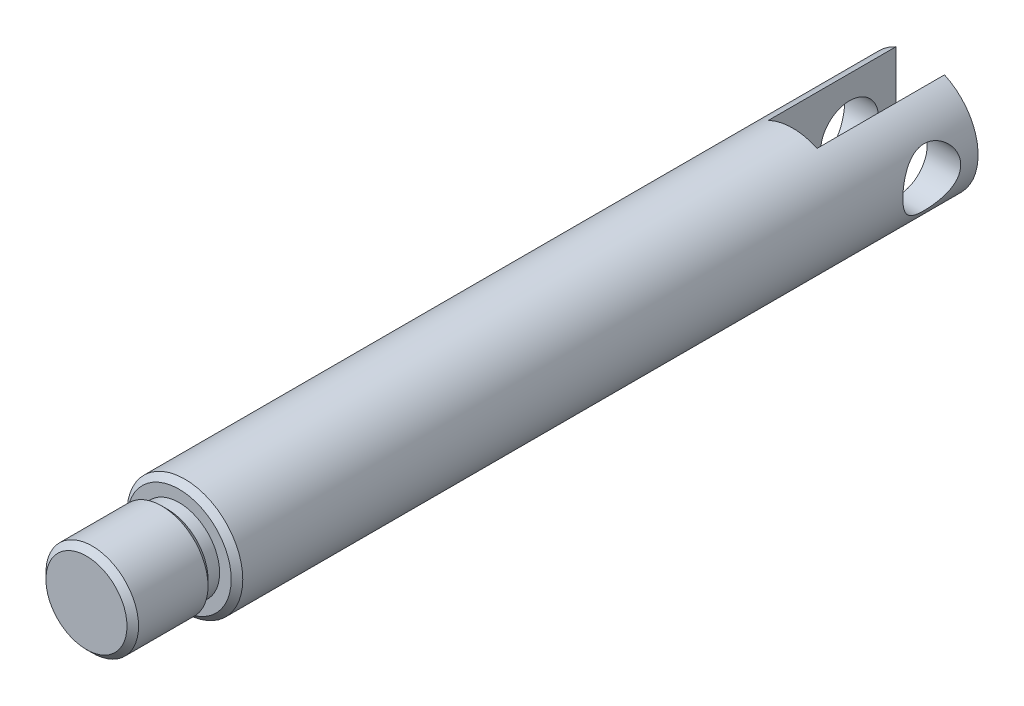
ISO-10303-21;
HEADER;
FILE_DESCRIPTION(('STEP AP214'),'2;1');
FILE_NAME('part.step','',(''),(''),'','','');
FILE_SCHEMA(('AUTOMOTIVE_DESIGN { 1 0 10303 214 1 1 1 1 }'));
ENDSEC;
DATA;
#1=APPLICATION_CONTEXT('core data for automotive mechanical design processes');
#2=APPLICATION_PROTOCOL_DEFINITION('international standard','automotive_design',2000,#1);
#3=PRODUCT_CONTEXT('',#1,'mechanical');
#4=PRODUCT('Part','Part','',(#3));
#5=PRODUCT_RELATED_PRODUCT_CATEGORY('part','',(#4));
#6=PRODUCT_DEFINITION_FORMATION('','',#4);
#7=PRODUCT_DEFINITION_CONTEXT('part definition',#1,'design');
#8=PRODUCT_DEFINITION('design','',#6,#7);
#9=PRODUCT_DEFINITION_SHAPE('','',#8);
#10=(LENGTH_UNIT() NAMED_UNIT(*) SI_UNIT(.MILLI.,.METRE.));
#11=(NAMED_UNIT(*) PLANE_ANGLE_UNIT() SI_UNIT($,.RADIAN.));
#12=(NAMED_UNIT(*) SI_UNIT($,.STERADIAN.) SOLID_ANGLE_UNIT());
#13=UNCERTAINTY_MEASURE_WITH_UNIT(LENGTH_MEASURE(1.E-05),#10,'distance_accuracy_value','');
#14=(GEOMETRIC_REPRESENTATION_CONTEXT(3) GLOBAL_UNCERTAINTY_ASSIGNED_CONTEXT((#13)) GLOBAL_UNIT_ASSIGNED_CONTEXT((#10,
#11,#12)) REPRESENTATION_CONTEXT('',''));
#15=CARTESIAN_POINT('',(0.,0.,0.));
#16=DIRECTION('',(0.,0.,1.));
#17=DIRECTION('',(1.,0.,0.));
#18=AXIS2_PLACEMENT_3D('',#15,#16,#17);
#19=CARTESIAN_POINT('',(0.,0.,0.));
#20=DIRECTION('',(0.,0.,1.));
#21=DIRECTION('',(1.,0.,0.));
#22=AXIS2_PLACEMENT_3D('',#19,#20,#21);
#23=PLANE('',#22);
#24=CARTESIAN_POINT('',(0.,0.,0.));
#25=DIRECTION('',(0.,0.,1.));
#26=DIRECTION('',(1.,0.,0.));
#27=AXIS2_PLACEMENT_3D('',#24,#25,#26);
#28=CIRCLE('',#27,2.5);
#29=CARTESIAN_POINT('',(-1.05,2.26881026090769,0.));
#30=VERTEX_POINT('',#29);
#31=CARTESIAN_POINT('',(-1.05,-2.26881026090769,0.));
#32=VERTEX_POINT('',#31);
#33=EDGE_CURVE('E107',#30,#32,#28,.T.);
#34=ORIENTED_EDGE('',*,*,#33,.F.);
#35=DIRECTION('',(0.,1.,0.));
#36=VECTOR('',#35,1.);
#37=CARTESIAN_POINT('',(-1.05,-2.5,0.));
#38=LINE('',#37,#36);
#39=EDGE_CURVE('E71',#32,#30,#38,.T.);
#40=ORIENTED_EDGE('',*,*,#39,.F.);
#41=EDGE_LOOP('',(#34,#40));
#42=FACE_BOUND('',#41,.T.);
#43=ADVANCED_FACE('F46',(#42),#23,.F.);
#44=CARTESIAN_POINT('',(-2.5,0.,2.));
#45=DIRECTION('',(1.,0.,0.));
#46=DIRECTION('',(0.,0.,-1.));
#47=AXIS2_PLACEMENT_3D('',#44,#45,#46);
#48=CYLINDRICAL_SURFACE('',#47,1.25);
#49=CARTESIAN_POINT('',(-1.05,0.,2.));
#50=DIRECTION('',(-1.,0.,0.));
#51=DIRECTION('',(0.,0.,1.));
#52=AXIS2_PLACEMENT_3D('',#49,#50,#51);
#53=CIRCLE('',#52,1.25);
#54=CARTESIAN_POINT('',(-1.05,0.,3.25));
#55=VERTEX_POINT('',#54);
#56=EDGE_CURVE('E103',#55,#55,#53,.F.);
#57=ORIENTED_EDGE('',*,*,#56,.T.);
#58=EDGE_LOOP('',(#57));
#59=FACE_BOUND('',#58,.T.);
#60=CARTESIAN_POINT('',(-2.5,0.,0.75));
#61=CARTESIAN_POINT('',(-2.49999641755189,0.065714953691233,0.750004127899376));
#62=CARTESIAN_POINT('',(-2.49738113774397,0.131508249622541,0.755212591402094));
#63=CARTESIAN_POINT('',(-2.48717695046745,0.261150294085531,0.775816100426147));
#64=CARTESIAN_POINT('',(-2.47957859786229,0.324995108391879,0.791230491247062));
#65=CARTESIAN_POINT('',(-2.46020349254139,0.448666931100718,0.831492260770993));
#66=CARTESIAN_POINT('',(-2.448442989719,0.508508503673975,0.856302980310015));
#67=CARTESIAN_POINT('',(-2.42182220644723,0.623090771008206,0.914463276706176));
#68=CARTESIAN_POINT('',(-2.40696217041912,0.677831867487562,0.947812180311065));
#69=CARTESIAN_POINT('',(-2.37445322822571,0.784384772202399,1.02439656185662));
#70=CARTESIAN_POINT('',(-2.3566899890942,0.83581901390264,1.06810809904955));
#71=CARTESIAN_POINT('',(-2.3207496280843,0.930974306083722,1.16315184905879));
#72=CARTESIAN_POINT('',(-2.30257220261294,0.974689478883458,1.21448981471555));
#73=CARTESIAN_POINT('',(-2.26623688996684,1.05656500056285,1.32810418690423));
#74=CARTESIAN_POINT('',(-2.24818983712665,1.09403166943955,1.39092012293239));
#75=CARTESIAN_POINT('',(-2.21607473465401,1.15771028361337,1.52295916998277));
#76=CARTESIAN_POINT('',(-2.20200384508737,1.18393026870792,1.59217766090344));
#77=CARTESIAN_POINT('',(-2.18072333797261,1.22266555273574,1.7308313817774));
#78=CARTESIAN_POINT('',(-2.17315339479642,1.23590732135055,1.80000556508424));
#79=CARTESIAN_POINT('',(-2.1647736243566,1.25053374163606,1.93997354722435));
#80=CARTESIAN_POINT('',(-2.1639571167911,1.25193011046634,2.01076567608894));
#81=CARTESIAN_POINT('',(-2.1688866282156,1.24335910896537,2.14285753039421));
#82=CARTESIAN_POINT('',(-2.17385954577517,1.23473069942103,2.20428003902881));
#83=CARTESIAN_POINT('',(-2.18845285917313,1.20867481132117,2.3246523867163));
#84=CARTESIAN_POINT('',(-2.1980747353972,1.19124452987206,2.38360143163164));
#85=CARTESIAN_POINT('',(-2.22109345515926,1.1477622254825,2.49903641570707));
#86=CARTESIAN_POINT('',(-2.23457300829998,1.12151883389499,2.55543299848224));
#87=CARTESIAN_POINT('',(-2.26379255351754,1.061302109585,2.66329286573751));
#88=CARTESIAN_POINT('',(-2.27953355975238,1.02732530476558,2.71475391950011));
#89=CARTESIAN_POINT('',(-2.31391447379107,0.947582568640986,2.81815156592903));
#90=CARTESIAN_POINT('',(-2.33266887795933,0.900868072961603,2.8693210919702));
#91=CARTESIAN_POINT('',(-2.36934529125509,0.799444473426718,2.96341927323863));
#92=CARTESIAN_POINT('',(-2.38726689948501,0.744731570717857,3.00634399004235));
#93=CARTESIAN_POINT('',(-2.42127484103705,0.625645632289811,3.08460707628716));
#94=CARTESIAN_POINT('',(-2.43723730202509,0.560941989499261,3.11950059055718));
#95=CARTESIAN_POINT('',(-2.46447351401553,0.425582769360996,3.17762128630376));
#96=CARTESIAN_POINT('',(-2.47575098679441,0.354931970331596,3.20085773126896));
#97=CARTESIAN_POINT('',(-2.49155417176795,0.215958114575877,3.23309425464584));
#98=CARTESIAN_POINT('',(-2.4965617287664,0.147926913185406,3.24311404468347));
#99=CARTESIAN_POINT('',(-2.50091266823877,0.0109744999366923,3.25183091391811));
#100=CARTESIAN_POINT('',(-2.5002587340164,-0.0579462748373765,3.25053335704935));
#101=CARTESIAN_POINT('',(-2.49363990316801,-0.189041214982492,3.23724163947656));
#102=CARTESIAN_POINT('',(-2.48809057110237,-0.251324260062443,3.22608433408746));
#103=CARTESIAN_POINT('',(-2.47277714143524,-0.373008615377396,3.19470241013114));
#104=CARTESIAN_POINT('',(-2.46301257917916,-0.432409607113746,3.1744767919333));
#105=CARTESIAN_POINT('',(-2.43980314267087,-0.548610760562081,3.12500191695853));
#106=CARTESIAN_POINT('',(-2.42626102212424,-0.605287996257692,3.09551118735398));
#107=CARTESIAN_POINT('',(-2.39679967896386,-0.713076702123651,3.02861558044245));
#108=CARTESIAN_POINT('',(-2.38087944457231,-0.764185787219102,2.99120733175821));
#109=CARTESIAN_POINT('',(-2.3463527667183,-0.864709611613316,2.90529946833391));
#110=CARTESIAN_POINT('',(-2.32763606060552,-0.913465097280798,2.85607141443304));
#111=CARTESIAN_POINT('',(-2.29077989504843,-1.00232040139155,2.75009356091337));
#112=CARTESIAN_POINT('',(-2.27264084226908,-1.04241423211355,2.69333860147953));
#113=CARTESIAN_POINT('',(-2.23813990282585,-1.11463489312212,2.57044543224961));
#114=CARTESIAN_POINT('',(-2.2219066207934,-1.1462818698483,2.50398591723926));
#115=CARTESIAN_POINT('',(-2.19467590460158,-1.19760353251725,2.36561241538435));
#116=CARTESIAN_POINT('',(-2.18367172800772,-1.21729364485946,2.29370559187352));
#117=CARTESIAN_POINT('',(-2.16951876260833,-1.2423271093121,2.15386222142319));
#118=CARTESIAN_POINT('',(-2.16571729325614,-1.24886624550108,2.08620718321371));
#119=CARTESIAN_POINT('',(-2.16456693307719,-1.25086144297598,1.95069116603659));
#120=CARTESIAN_POINT('',(-2.16721524534441,-1.2463223082805,1.88283028907571));
#121=CARTESIAN_POINT('',(-2.17797327562531,-1.22740765699033,1.75564562308498));
#122=CARTESIAN_POINT('',(-2.18553868102992,-1.2140103929285,1.6961244123195));
#123=CARTESIAN_POINT('',(-2.20463770234897,-1.17896919778081,1.58023985071912));
#124=CARTESIAN_POINT('',(-2.21617259462094,-1.15732261394976,1.52387752238504));
#125=CARTESIAN_POINT('',(-2.2428566295566,-1.10476968162585,1.41171893626674));
#126=CARTESIAN_POINT('',(-2.25819652995238,-1.07333892227057,1.35621512271287));
#127=CARTESIAN_POINT('',(-2.29044164543238,-1.00268871454579,1.25090682977427));
#128=CARTESIAN_POINT('',(-2.30734767243153,-0.96346521404831,1.20110533685189));
#129=CARTESIAN_POINT('',(-2.34327903949141,-0.872754158330802,1.10232252205298));
#130=CARTESIAN_POINT('',(-2.36231229139336,-0.820355528762714,1.0541761220476));
#131=CARTESIAN_POINT('',(-2.3984719031886,-0.70769350777535,0.967171270720459));
#132=CARTESIAN_POINT('',(-2.4155972326005,-0.647425904070981,0.928317825717139));
#133=CARTESIAN_POINT('',(-2.44622511981379,-0.519914496024933,0.860954546547245));
#134=CARTESIAN_POINT('',(-2.45970120703636,-0.452624379918268,0.832519788235707));
#135=CARTESIAN_POINT('',(-2.48126676704332,-0.313427626617739,0.78773979010131));
#136=CARTESIAN_POINT('',(-2.48937154216165,-0.241534749528957,0.771360191463028));
#137=CARTESIAN_POINT('',(-2.49619327387079,-0.14075243310423,0.757628236155188));
#138=CARTESIAN_POINT('',(-2.49761706674002,-0.112702349299373,0.754771698920476));
#139=CARTESIAN_POINT('',(-2.49952121222331,-0.0564396647589471,0.750956668103993));
#140=CARTESIAN_POINT('',(-2.50000153879704,-0.0282270595592267,0.749998226911));
#141=CARTESIAN_POINT('',(-2.5,0.,0.75));
#142=B_SPLINE_CURVE_WITH_KNOTS('',3,(#60,#61,#62,#63,#64,#65,#66,#67,#68,#69,#70,#71,#72,#73,
#74,#75,#76,#77,#78,#79,#80,#81,#82,#83,#84,#85,#86,#87,#88,#89,#90,#91,#92,#93,#94,#95,#96,#97,
#98,#99,#100,#101,#102,#103,#104,#105,#106,#107,#108,#109,#110,#111,#112,#113,#114,#115,#116,
#117,#118,#119,#120,#121,#122,#123,#124,#125,#126,#127,#128,#129,#130,#131,#132,#133,#134,#135,
#136,#137,#138,#139,#140,#141),.UNSPECIFIED.,.T.,.F.,(4,2,2,2,2,2,2,2,2,2,2,2,2,2,2,2,2,2,2,2,2,
2,2,2,2,2,2,2,2,2,2,2,2,2,2,2,2,2,2,2,4),(0.,0.197030321775365,0.394435187136497,
0.591077694365372,0.787704700726959,0.996227198397611,1.20490779706754,1.42977158038441,
1.65447434872851,1.86572515175287,2.07676696661275,2.26257140511651,2.44843504907098,
2.63862800210609,2.82890651575277,3.04331176667348,3.25781918248358,3.48228777768051,
3.70657771140349,3.91229113089182,4.11790705639345,4.30758633132652,4.49728652038664,
4.69241070034873,4.88761813435424,5.10199513305523,5.3165198576929,5.54143352699592,
5.76605639925972,5.96911634372967,6.17208824825007,6.35572412805228,6.53941910979597,
6.73545570969518,6.93159451423697,7.15156553440623,7.37165479220716,7.59330017078656,
7.81431135781162,7.89894100172122,7.98357298143558),.UNSPECIFIED.);
#143=CARTESIAN_POINT('',(-2.5,0.,0.75));
#144=VERTEX_POINT('',#143);
#145=EDGE_CURVE('E148',#144,#144,#142,.T.);
#146=ORIENTED_EDGE('',*,*,#145,.F.);
#147=EDGE_LOOP('',(#146));
#148=FACE_BOUND('',#147,.T.);
#149=ADVANCED_FACE('F163',(#59,#148),#48,.F.);
#150=CARTESIAN_POINT('',(0.,0.,32.));
#151=DIRECTION('',(0.,0.,-1.));
#152=DIRECTION('',(-1.,0.,0.));
#153=AXIS2_PLACEMENT_3D('',#150,#151,#152);
#154=CYLINDRICAL_SURFACE('',#153,2.5);
#155=ORIENTED_EDGE('',*,*,#145,.T.);
#156=EDGE_LOOP('',(#155));
#157=FACE_BOUND('',#156,.T.);
#158=CARTESIAN_POINT('',(2.5,0.,0.75));
#159=CARTESIAN_POINT('',(2.49999641755189,-0.065714953691233,0.750004127899376));
#160=CARTESIAN_POINT('',(2.49738113774397,-0.131508249622541,0.755212591402094));
#161=CARTESIAN_POINT('',(2.48717695046745,-0.261150294085531,0.775816100426147));
#162=CARTESIAN_POINT('',(2.47957859786229,-0.324995108391879,0.791230491247062));
#163=CARTESIAN_POINT('',(2.46020349254139,-0.448666931100718,0.831492260770993));
#164=CARTESIAN_POINT('',(2.448442989719,-0.508508503673975,0.856302980310015));
#165=CARTESIAN_POINT('',(2.42182220644723,-0.623090771008206,0.914463276706176));
#166=CARTESIAN_POINT('',(2.40696217041912,-0.677831867487562,0.947812180311065));
#167=CARTESIAN_POINT('',(2.37445322822571,-0.784384772202399,1.02439656185662));
#168=CARTESIAN_POINT('',(2.3566899890942,-0.83581901390264,1.06810809904955));
#169=CARTESIAN_POINT('',(2.3207496280843,-0.930974306083722,1.16315184905879));
#170=CARTESIAN_POINT('',(2.30257220261294,-0.974689478883458,1.21448981471555));
#171=CARTESIAN_POINT('',(2.26623688996684,-1.05656500056285,1.32810418690423));
#172=CARTESIAN_POINT('',(2.24818983712665,-1.09403166943955,1.39092012293239));
#173=CARTESIAN_POINT('',(2.21607473465401,-1.15771028361337,1.52295916998277));
#174=CARTESIAN_POINT('',(2.20200384508737,-1.18393026870792,1.59217766090344));
#175=CARTESIAN_POINT('',(2.18072333797261,-1.22266555273574,1.7308313817774));
#176=CARTESIAN_POINT('',(2.17315339479642,-1.23590732135055,1.80000556508424));
#177=CARTESIAN_POINT('',(2.1647736243566,-1.25053374163606,1.93997354722435));
#178=CARTESIAN_POINT('',(2.1639571167911,-1.25193011046634,2.01076567608894));
#179=CARTESIAN_POINT('',(2.1688866282156,-1.24335910896537,2.14285753039421));
#180=CARTESIAN_POINT('',(2.17385954577517,-1.23473069942103,2.20428003902881));
#181=CARTESIAN_POINT('',(2.18845285917313,-1.20867481132117,2.3246523867163));
#182=CARTESIAN_POINT('',(2.1980747353972,-1.19124452987206,2.38360143163164));
#183=CARTESIAN_POINT('',(2.22109345515926,-1.1477622254825,2.49903641570707));
#184=CARTESIAN_POINT('',(2.23457300829998,-1.12151883389499,2.55543299848224));
#185=CARTESIAN_POINT('',(2.26379255351754,-1.061302109585,2.66329286573751));
#186=CARTESIAN_POINT('',(2.27953355975238,-1.02732530476558,2.71475391950011));
#187=CARTESIAN_POINT('',(2.31391447379107,-0.947582568640986,2.81815156592903));
#188=CARTESIAN_POINT('',(2.33266887795933,-0.900868072961603,2.8693210919702));
#189=CARTESIAN_POINT('',(2.36934529125509,-0.799444473426718,2.96341927323863));
#190=CARTESIAN_POINT('',(2.38726689948501,-0.744731570717857,3.00634399004235));
#191=CARTESIAN_POINT('',(2.42127484103705,-0.625645632289811,3.08460707628716));
#192=CARTESIAN_POINT('',(2.43723730202509,-0.560941989499261,3.11950059055718));
#193=CARTESIAN_POINT('',(2.46447351401553,-0.425582769360996,3.17762128630376));
#194=CARTESIAN_POINT('',(2.47575098679441,-0.354931970331596,3.20085773126896));
#195=CARTESIAN_POINT('',(2.49155417176795,-0.215958114575877,3.23309425464584));
#196=CARTESIAN_POINT('',(2.4965617287664,-0.147926913185406,3.24311404468347));
#197=CARTESIAN_POINT('',(2.50091266823877,-0.0109744999366923,3.25183091391811));
#198=CARTESIAN_POINT('',(2.5002587340164,0.0579462748373765,3.25053335704935));
#199=CARTESIAN_POINT('',(2.49363990316801,0.189041214982492,3.23724163947656));
#200=CARTESIAN_POINT('',(2.48809057110237,0.251324260062443,3.22608433408746));
#201=CARTESIAN_POINT('',(2.47277714143524,0.373008615377396,3.19470241013114));
#202=CARTESIAN_POINT('',(2.46301257917916,0.432409607113746,3.1744767919333));
#203=CARTESIAN_POINT('',(2.43980314267087,0.548610760562081,3.12500191695853));
#204=CARTESIAN_POINT('',(2.42626102212424,0.605287996257692,3.09551118735398));
#205=CARTESIAN_POINT('',(2.39679967896386,0.713076702123651,3.02861558044245));
#206=CARTESIAN_POINT('',(2.38087944457231,0.764185787219102,2.99120733175821));
#207=CARTESIAN_POINT('',(2.3463527667183,0.864709611613316,2.90529946833391));
#208=CARTESIAN_POINT('',(2.32763606060552,0.913465097280798,2.85607141443304));
#209=CARTESIAN_POINT('',(2.29077989504843,1.00232040139155,2.75009356091337));
#210=CARTESIAN_POINT('',(2.27264084226908,1.04241423211355,2.69333860147953));
#211=CARTESIAN_POINT('',(2.23813990282585,1.11463489312212,2.57044543224961));
#212=CARTESIAN_POINT('',(2.2219066207934,1.1462818698483,2.50398591723926));
#213=CARTESIAN_POINT('',(2.19467590460158,1.19760353251725,2.36561241538435));
#214=CARTESIAN_POINT('',(2.18367172800772,1.21729364485946,2.29370559187352));
#215=CARTESIAN_POINT('',(2.16951876260833,1.2423271093121,2.15386222142319));
#216=CARTESIAN_POINT('',(2.16571729325614,1.24886624550108,2.08620718321371));
#217=CARTESIAN_POINT('',(2.16456693307719,1.25086144297598,1.95069116603659));
#218=CARTESIAN_POINT('',(2.16721524534441,1.2463223082805,1.88283028907571));
#219=CARTESIAN_POINT('',(2.17797327562531,1.22740765699033,1.75564562308498));
#220=CARTESIAN_POINT('',(2.18553868102992,1.2140103929285,1.6961244123195));
#221=CARTESIAN_POINT('',(2.20463770234897,1.17896919778081,1.58023985071912));
#222=CARTESIAN_POINT('',(2.21617259462094,1.15732261394976,1.52387752238504));
#223=CARTESIAN_POINT('',(2.2428566295566,1.10476968162585,1.41171893626674));
#224=CARTESIAN_POINT('',(2.25819652995238,1.07333892227057,1.35621512271287));
#225=CARTESIAN_POINT('',(2.29044164543238,1.00268871454579,1.25090682977427));
#226=CARTESIAN_POINT('',(2.30734767243153,0.96346521404831,1.20110533685189));
#227=CARTESIAN_POINT('',(2.34327903949141,0.872754158330802,1.10232252205298));
#228=CARTESIAN_POINT('',(2.36231229139336,0.820355528762714,1.0541761220476));
#229=CARTESIAN_POINT('',(2.3984719031886,0.70769350777535,0.967171270720459));
#230=CARTESIAN_POINT('',(2.4155972326005,0.647425904070981,0.928317825717139));
#231=CARTESIAN_POINT('',(2.44622511981379,0.519914496024933,0.860954546547245));
#232=CARTESIAN_POINT('',(2.45970120703636,0.452624379918268,0.832519788235707));
#233=CARTESIAN_POINT('',(2.48126676704332,0.313427626617739,0.78773979010131));
#234=CARTESIAN_POINT('',(2.48937154216165,0.241534749528957,0.771360191463028));
#235=CARTESIAN_POINT('',(2.49619327387079,0.14075243310423,0.757628236155188));
#236=CARTESIAN_POINT('',(2.49761706674002,0.112702349299373,0.754771698920476));
#237=CARTESIAN_POINT('',(2.49952121222331,0.0564396647589471,0.750956668103993));
#238=CARTESIAN_POINT('',(2.50000153879704,0.0282270595592267,0.749998226911));
#239=CARTESIAN_POINT('',(2.5,0.,0.75));
#240=B_SPLINE_CURVE_WITH_KNOTS('',3,(#158,#159,#160,#161,#162,#163,#164,#165,#166,#167,#168,
#169,#170,#171,#172,#173,#174,#175,#176,#177,#178,#179,#180,#181,#182,#183,#184,#185,#186,#187,
#188,#189,#190,#191,#192,#193,#194,#195,#196,#197,#198,#199,#200,#201,#202,#203,#204,#205,#206,
#207,#208,#209,#210,#211,#212,#213,#214,#215,#216,#217,#218,#219,#220,#221,#222,#223,#224,#225,
#226,#227,#228,#229,#230,#231,#232,#233,#234,#235,#236,#237,#238,#239),.UNSPECIFIED.,.T.,.F.,(4,
2,2,2,2,2,2,2,2,2,2,2,2,2,2,2,2,2,2,2,2,2,2,2,2,2,2,2,2,2,2,2,2,2,2,2,2,2,2,2,4),(0.,
0.197030321775365,0.394435187136497,0.591077694365372,0.787704700726959,0.996227198397611,
1.20490779706754,1.42977158038441,1.65447434872851,1.86572515175287,2.07676696661275,
2.26257140511651,2.44843504907098,2.63862800210609,2.82890651575277,3.04331176667348,
3.25781918248358,3.48228777768051,3.70657771140349,3.91229113089182,4.11790705639345,
4.30758633132652,4.49728652038664,4.69241070034873,4.88761813435424,5.10199513305523,
5.3165198576929,5.54143352699592,5.76605639925972,5.96911634372967,6.17208824825007,
6.35572412805228,6.53941910979597,6.73545570969518,6.93159451423697,7.15156553440623,
7.37165479220716,7.59330017078656,7.81431135781162,7.89894100172122,7.98357298143558),.UNSPECIFIED.);
#241=CARTESIAN_POINT('',(2.5,0.,0.75));
#242=VERTEX_POINT('',#241);
#243=EDGE_CURVE('E139',#242,#242,#240,.T.);
#244=ORIENTED_EDGE('',*,*,#243,.T.);
#245=EDGE_LOOP('',(#244));
#246=FACE_BOUND('',#245,.T.);
#247=CARTESIAN_POINT('',(0.,0.,31.75));
#248=DIRECTION('',(0.,0.,1.));
#249=DIRECTION('',(1.,0.,0.));
#250=AXIS2_PLACEMENT_3D('',#247,#248,#249);
#251=CIRCLE('',#250,2.5);
#252=CARTESIAN_POINT('',(2.5,0.,31.75));
#253=VERTEX_POINT('',#252);
#254=EDGE_CURVE('E123',#253,#253,#251,.F.);
#255=ORIENTED_EDGE('',*,*,#254,.T.);
#256=EDGE_LOOP('',(#255));
#257=FACE_BOUND('',#256,.T.);
#258=CARTESIAN_POINT('',(1.05,-2.26881026090769,0.));
#259=VERTEX_POINT('',#258);
#260=CARTESIAN_POINT('',(1.05,2.26881026090769,0.));
#261=VERTEX_POINT('',#260);
#262=EDGE_CURVE('E100',#259,#261,#28,.T.);
#263=ORIENTED_EDGE('',*,*,#262,.T.);
#264=DIRECTION('',(0.,0.,-1.));
#265=VECTOR('',#264,1.);
#266=CARTESIAN_POINT('',(1.05,2.26881026090768,32.));
#267=LINE('',#266,#265);
#268=CARTESIAN_POINT('',(1.05,2.26881026090769,5.5));
#269=VERTEX_POINT('',#268);
#270=EDGE_CURVE('E63',#261,#269,#267,.F.);
#271=ORIENTED_EDGE('',*,*,#270,.T.);
#272=CARTESIAN_POINT('',(0.,0.,5.5));
#273=DIRECTION('',(0.,0.,1.));
#274=DIRECTION('',(1.,0.,0.));
#275=AXIS2_PLACEMENT_3D('',#272,#273,#274);
#276=CIRCLE('',#275,2.5);
#277=CARTESIAN_POINT('',(-1.05,2.26881026090769,5.5));
#278=VERTEX_POINT('',#277);
#279=EDGE_CURVE('E51',#269,#278,#276,.T.);
#280=ORIENTED_EDGE('',*,*,#279,.T.);
#281=DIRECTION('',(0.,0.,-1.));
#282=VECTOR('',#281,1.);
#283=CARTESIAN_POINT('',(-1.05,2.26881026090769,32.));
#284=LINE('',#283,#282);
#285=EDGE_CURVE('E115',#278,#30,#284,.T.);
#286=ORIENTED_EDGE('',*,*,#285,.T.);
#287=ORIENTED_EDGE('',*,*,#33,.T.);
#288=DIRECTION('',(0.,0.,-1.));
#289=VECTOR('',#288,1.);
#290=CARTESIAN_POINT('',(-1.05,-2.26881026090769,32.));
#291=LINE('',#290,#289);
#292=CARTESIAN_POINT('',(-1.05,-2.26881026090769,5.5));
#293=VERTEX_POINT('',#292);
#294=EDGE_CURVE('E193',#32,#293,#291,.F.);
#295=ORIENTED_EDGE('',*,*,#294,.T.);
#296=CARTESIAN_POINT('',(1.05,-2.26881026090769,5.5));
#297=VERTEX_POINT('',#296);
#298=EDGE_CURVE('E11',#293,#297,#276,.T.);
#299=ORIENTED_EDGE('',*,*,#298,.T.);
#300=DIRECTION('',(0.,0.,-1.));
#301=VECTOR('',#300,1.);
#302=CARTESIAN_POINT('',(1.05,-2.26881026090768,32.));
#303=LINE('',#302,#301);
#304=EDGE_CURVE('E90',#297,#259,#303,.T.);
#305=ORIENTED_EDGE('',*,*,#304,.T.);
#306=EDGE_LOOP('',(#263,#271,#280,#286,#287,#295,#299,#305));
#307=FACE_BOUND('',#306,.T.);
#308=ADVANCED_FACE('F99',(#157,#246,#257,#307),#154,.T.);
#309=CARTESIAN_POINT('',(0.,0.,32.));
#310=DIRECTION('',(0.,0.,1.));
#311=DIRECTION('',(1.,0.,0.));
#312=AXIS2_PLACEMENT_3D('',#309,#310,#311);
#313=PLANE('',#312);
#314=CARTESIAN_POINT('',(0.,0.,32.));
#315=DIRECTION('',(0.,0.,1.));
#316=DIRECTION('',(1.,0.,0.));
#317=AXIS2_PLACEMENT_3D('',#314,#315,#316);
#318=CIRCLE('',#317,2.25);
#319=CARTESIAN_POINT('',(2.25,0.,32.));
#320=VERTEX_POINT('',#319);
#321=EDGE_CURVE('E119',#320,#320,#318,.T.);
#322=ORIENTED_EDGE('',*,*,#321,.T.);
#323=EDGE_LOOP('',(#322));
#324=FACE_BOUND('',#323,.T.);
#325=CARTESIAN_POINT('',(0.,0.,32.));
#326=DIRECTION('',(0.,0.,1.));
#327=DIRECTION('',(1.,0.,0.));
#328=AXIS2_PLACEMENT_3D('',#325,#326,#327);
#329=CIRCLE('',#328,1.75);
#330=CARTESIAN_POINT('',(1.75,0.,32.));
#331=VERTEX_POINT('',#330);
#332=EDGE_CURVE('E113',#331,#331,#329,.T.);
#333=ORIENTED_EDGE('',*,*,#332,.F.);
#334=EDGE_LOOP('',(#333));
#335=FACE_BOUND('',#334,.T.);
#336=ADVANCED_FACE('F180',(#324,#335),#313,.T.);
#337=ORIENTED_EDGE('',*,*,#262,.F.);
#338=DIRECTION('',(0.,1.,0.));
#339=VECTOR('',#338,1.);
#340=CARTESIAN_POINT('',(1.05,-2.5,0.));
#341=LINE('',#340,#339);
#342=EDGE_CURVE('E87',#259,#261,#341,.T.);
#343=ORIENTED_EDGE('',*,*,#342,.T.);
#344=EDGE_LOOP('',(#337,#343));
#345=FACE_BOUND('',#344,.T.);
#346=ADVANCED_FACE('F105',(#345),#23,.F.);
#347=CARTESIAN_POINT('',(0.,0.,32.5));
#348=DIRECTION('',(0.,0.,-1.));
#349=DIRECTION('',(-1.,0.,0.));
#350=AXIS2_PLACEMENT_3D('',#347,#348,#349);
#351=CYLINDRICAL_SURFACE('',#350,1.75);
#352=CARTESIAN_POINT('',(0.,0.,32.5));
#353=DIRECTION('',(0.,0.,1.));
#354=DIRECTION('',(1.,0.,0.));
#355=AXIS2_PLACEMENT_3D('',#352,#353,#354);
#356=CIRCLE('',#355,1.75);
#357=CARTESIAN_POINT('',(1.75,0.,32.5));
#358=VERTEX_POINT('',#357);
#359=EDGE_CURVE('E108',#358,#358,#356,.T.);
#360=ORIENTED_EDGE('',*,*,#359,.F.);
#361=EDGE_LOOP('',(#360));
#362=FACE_BOUND('',#361,.T.);
#363=ORIENTED_EDGE('',*,*,#332,.T.);
#364=EDGE_LOOP('',(#363));
#365=FACE_BOUND('',#364,.T.);
#366=ADVANCED_FACE('F175',(#362,#365),#351,.T.);
#367=CARTESIAN_POINT('',(0.,0.,36.));
#368=DIRECTION('',(0.,0.,-1.));
#369=DIRECTION('',(-1.,0.,0.));
#370=AXIS2_PLACEMENT_3D('',#367,#368,#369);
#371=CYLINDRICAL_SURFACE('',#370,2.);
#372=CARTESIAN_POINT('',(0.,0.,32.75));
#373=DIRECTION('',(0.,0.,1.));
#374=DIRECTION('',(1.,0.,0.));
#375=AXIS2_PLACEMENT_3D('',#372,#373,#374);
#376=CIRCLE('',#375,2.);
#377=CARTESIAN_POINT('',(2.,0.,32.75));
#378=VERTEX_POINT('',#377);
#379=EDGE_CURVE('E131',#378,#378,#376,.T.);
#380=ORIENTED_EDGE('',*,*,#379,.T.);
#381=EDGE_LOOP('',(#380));
#382=FACE_BOUND('',#381,.T.);
#383=CARTESIAN_POINT('',(0.,0.,35.75));
#384=DIRECTION('',(0.,0.,1.));
#385=DIRECTION('',(1.,0.,0.));
#386=AXIS2_PLACEMENT_3D('',#383,#384,#385);
#387=CIRCLE('',#386,2.);
#388=CARTESIAN_POINT('',(2.,0.,35.75));
#389=VERTEX_POINT('',#388);
#390=EDGE_CURVE('E127',#389,#389,#387,.F.);
#391=ORIENTED_EDGE('',*,*,#390,.T.);
#392=EDGE_LOOP('',(#391));
#393=FACE_BOUND('',#392,.T.);
#394=ADVANCED_FACE('F171',(#382,#393),#371,.T.);
#395=CARTESIAN_POINT('',(0.,0.,36.));
#396=DIRECTION('',(0.,0.,1.));
#397=DIRECTION('',(1.,0.,0.));
#398=AXIS2_PLACEMENT_3D('',#395,#396,#397);
#399=PLANE('',#398);
#400=CARTESIAN_POINT('',(0.,0.,36.));
#401=DIRECTION('',(0.,0.,1.));
#402=DIRECTION('',(1.,0.,0.));
#403=AXIS2_PLACEMENT_3D('',#400,#401,#402);
#404=CIRCLE('',#403,1.75);
#405=CARTESIAN_POINT('',(1.75,0.,36.));
#406=VERTEX_POINT('',#405);
#407=EDGE_CURVE('E135',#406,#406,#404,.T.);
#408=ORIENTED_EDGE('',*,*,#407,.T.);
#409=EDGE_LOOP('',(#408));
#410=FACE_BOUND('',#409,.T.);
#411=ADVANCED_FACE('F166',(#410),#399,.T.);
#412=CARTESIAN_POINT('',(0.,0.,32.));
#413=DIRECTION('',(0.,0.,-1.));
#414=DIRECTION('',(-1.,0.,0.));
#415=AXIS2_PLACEMENT_3D('',#412,#413,#414);
#416=CONICAL_SURFACE('',#415,2.25,0.785398163397436);
#417=ORIENTED_EDGE('',*,*,#254,.F.);
#418=EDGE_LOOP('',(#417));
#419=FACE_BOUND('',#418,.T.);
#420=ORIENTED_EDGE('',*,*,#321,.F.);
#421=EDGE_LOOP('',(#420));
#422=FACE_BOUND('',#421,.T.);
#423=ADVANCED_FACE('F170',(#419,#422),#416,.T.);
#424=CARTESIAN_POINT('',(0.,0.,32.75));
#425=DIRECTION('',(0.,0.,1.));
#426=DIRECTION('',(1.,0.,0.));
#427=AXIS2_PLACEMENT_3D('',#424,#425,#426);
#428=CONICAL_SURFACE('',#427,2.,0.785398163397452);
#429=ORIENTED_EDGE('',*,*,#359,.T.);
#430=EDGE_LOOP('',(#429));
#431=FACE_BOUND('',#430,.T.);
#432=ORIENTED_EDGE('',*,*,#379,.F.);
#433=EDGE_LOOP('',(#432));
#434=FACE_BOUND('',#433,.T.);
#435=ADVANCED_FACE('F234',(#431,#434),#428,.T.);
#436=CARTESIAN_POINT('',(0.,0.,36.));
#437=DIRECTION('',(0.,0.,-1.));
#438=DIRECTION('',(-1.,0.,0.));
#439=AXIS2_PLACEMENT_3D('',#436,#437,#438);
#440=CONICAL_SURFACE('',#439,1.75,0.785398163397445);
#441=ORIENTED_EDGE('',*,*,#390,.F.);
#442=EDGE_LOOP('',(#441));
#443=FACE_BOUND('',#442,.T.);
#444=ORIENTED_EDGE('',*,*,#407,.F.);
#445=EDGE_LOOP('',(#444));
#446=FACE_BOUND('',#445,.T.);
#447=ADVANCED_FACE('F49',(#443,#446),#440,.T.);
#448=CARTESIAN_POINT('',(1.05,0.,2.));
#449=DIRECTION('',(1.,0.,0.));
#450=DIRECTION('',(0.,0.,-1.));
#451=AXIS2_PLACEMENT_3D('',#448,#449,#450);
#452=CIRCLE('',#451,1.25);
#453=CARTESIAN_POINT('',(1.05,0.,0.75));
#454=VERTEX_POINT('',#453);
#455=EDGE_CURVE('E204',#454,#454,#452,.F.);
#456=ORIENTED_EDGE('',*,*,#455,.T.);
#457=EDGE_LOOP('',(#456));
#458=FACE_BOUND('',#457,.T.);
#459=ORIENTED_EDGE('',*,*,#243,.F.);
#460=EDGE_LOOP('',(#459));
#461=FACE_BOUND('',#460,.T.);
#462=ADVANCED_FACE('F156',(#458,#461),#48,.F.);
#463=CARTESIAN_POINT('',(-1.05,-2.5,5.5));
#464=DIRECTION('',(0.,0.,1.));
#465=DIRECTION('',(1.,0.,0.));
#466=AXIS2_PLACEMENT_3D('',#463,#464,#465);
#467=PLANE('',#466);
#468=DIRECTION('',(0.,1.,0.));
#469=VECTOR('',#468,1.);
#470=CARTESIAN_POINT('',(1.05,-2.5,5.5));
#471=LINE('',#470,#469);
#472=EDGE_CURVE('E96',#297,#269,#471,.T.);
#473=ORIENTED_EDGE('',*,*,#472,.F.);
#474=ORIENTED_EDGE('',*,*,#298,.F.);
#475=DIRECTION('',(0.,1.,0.));
#476=VECTOR('',#475,1.);
#477=CARTESIAN_POINT('',(-1.05,-2.5,5.5));
#478=LINE('',#477,#476);
#479=EDGE_CURVE('E205',#293,#278,#478,.T.);
#480=ORIENTED_EDGE('',*,*,#479,.T.);
#481=ORIENTED_EDGE('',*,*,#279,.F.);
#482=EDGE_LOOP('',(#473,#474,#480,#481));
#483=FACE_BOUND('',#482,.T.);
#484=ADVANCED_FACE('F161',(#483),#467,.F.);
#485=CARTESIAN_POINT('',(-1.05,-2.5,0.));
#486=DIRECTION('',(-1.,0.,0.));
#487=DIRECTION('',(0.,0.,1.));
#488=AXIS2_PLACEMENT_3D('',#485,#486,#487);
#489=PLANE('',#488);
#490=ORIENTED_EDGE('',*,*,#56,.F.);
#491=EDGE_LOOP('',(#490));
#492=FACE_BOUND('',#491,.T.);
#493=ORIENTED_EDGE('',*,*,#479,.F.);
#494=ORIENTED_EDGE('',*,*,#294,.F.);
#495=ORIENTED_EDGE('',*,*,#39,.T.);
#496=ORIENTED_EDGE('',*,*,#285,.F.);
#497=EDGE_LOOP('',(#493,#494,#495,#496));
#498=FACE_BOUND('',#497,.T.);
#499=ADVANCED_FACE('F164',(#492,#498),#489,.F.);
#500=CARTESIAN_POINT('',(1.05,-2.5,0.));
#501=DIRECTION('',(1.,0.,0.));
#502=DIRECTION('',(0.,0.,-1.));
#503=AXIS2_PLACEMENT_3D('',#500,#501,#502);
#504=PLANE('',#503);
#505=ORIENTED_EDGE('',*,*,#455,.F.);
#506=EDGE_LOOP('',(#505));
#507=FACE_BOUND('',#506,.T.);
#508=ORIENTED_EDGE('',*,*,#472,.T.);
#509=ORIENTED_EDGE('',*,*,#270,.F.);
#510=ORIENTED_EDGE('',*,*,#342,.F.);
#511=ORIENTED_EDGE('',*,*,#304,.F.);
#512=EDGE_LOOP('',(#508,#509,#510,#511));
#513=FACE_BOUND('',#512,.T.);
#514=ADVANCED_FACE('F89',(#507,#513),#504,.F.);
#515=CLOSED_SHELL('',(#43,#149,#308,#336,#346,#366,#394,#411,#423,#435,#447,#462,#484,#499,#514));
#516=MANIFOLD_SOLID_BREP('B2',#515);
#517=ADVANCED_BREP_SHAPE_REPRESENTATION('',(#18,#516),#14);
#518=SHAPE_DEFINITION_REPRESENTATION(#9,#517);
ENDSEC;
END-ISO-10303-21;
